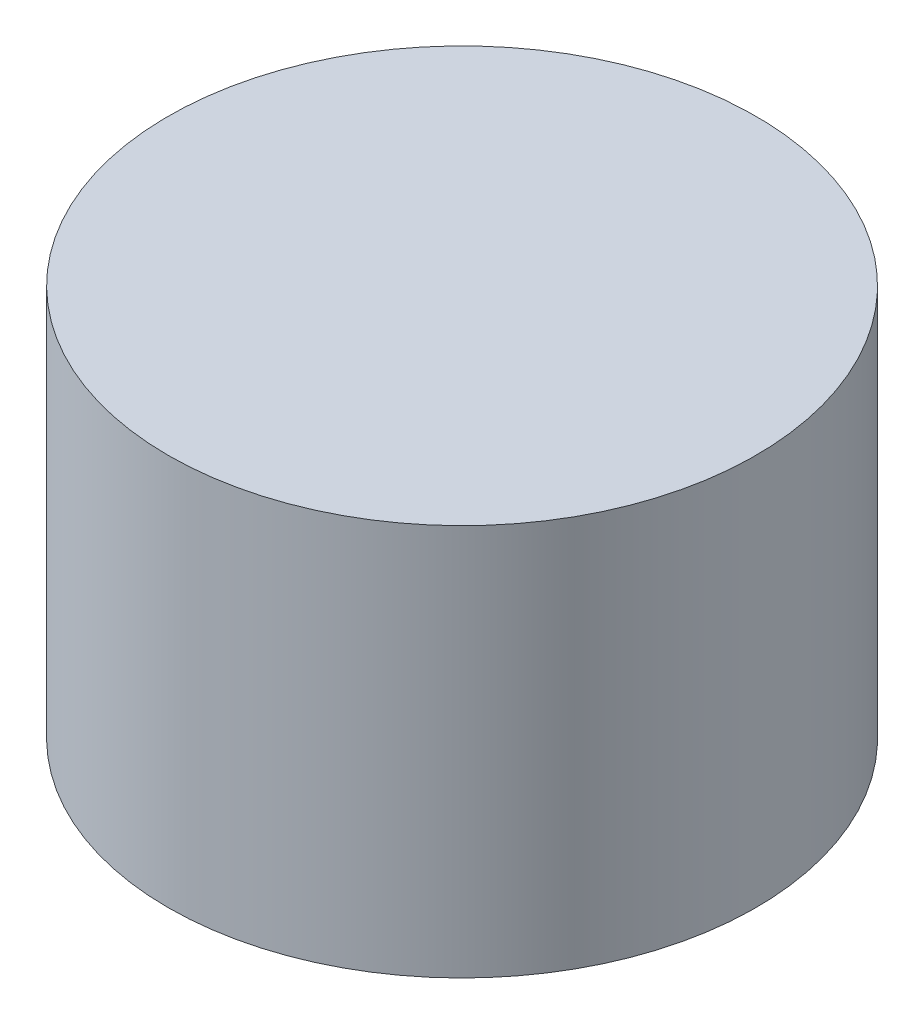
ISO-10303-21;
HEADER;
FILE_DESCRIPTION(('STEP AP214'),'2;1');
FILE_NAME('part.step','',(''),(''),'','','');
FILE_SCHEMA(('AUTOMOTIVE_DESIGN { 1 0 10303 214 1 1 1 1 }'));
ENDSEC;
DATA;
#1=APPLICATION_CONTEXT('core data for automotive mechanical design processes');
#2=APPLICATION_PROTOCOL_DEFINITION('international standard','automotive_design',2000,#1);
#3=PRODUCT_CONTEXT('',#1,'mechanical');
#4=PRODUCT('Part','Part','',(#3));
#5=PRODUCT_RELATED_PRODUCT_CATEGORY('part','',(#4));
#6=PRODUCT_DEFINITION_FORMATION('','',#4);
#7=PRODUCT_DEFINITION_CONTEXT('part definition',#1,'design');
#8=PRODUCT_DEFINITION('design','',#6,#7);
#9=PRODUCT_DEFINITION_SHAPE('','',#8);
#10=(LENGTH_UNIT() NAMED_UNIT(*) SI_UNIT(.MILLI.,.METRE.));
#11=(NAMED_UNIT(*) PLANE_ANGLE_UNIT() SI_UNIT($,.RADIAN.));
#12=(NAMED_UNIT(*) SI_UNIT($,.STERADIAN.) SOLID_ANGLE_UNIT());
#13=UNCERTAINTY_MEASURE_WITH_UNIT(LENGTH_MEASURE(1.E-05),#10,'distance_accuracy_value','');
#14=(GEOMETRIC_REPRESENTATION_CONTEXT(3) GLOBAL_UNCERTAINTY_ASSIGNED_CONTEXT((#13)) GLOBAL_UNIT_ASSIGNED_CONTEXT((#10,
#11,#12)) REPRESENTATION_CONTEXT('',''));
#15=CARTESIAN_POINT('',(0.,0.,0.));
#16=DIRECTION('',(0.,0.,1.));
#17=DIRECTION('',(1.,0.,0.));
#18=AXIS2_PLACEMENT_3D('',#15,#16,#17);
#19=CARTESIAN_POINT('',(0.,20.,0.));
#20=DIRECTION('',(0.,-1.,0.));
#21=DIRECTION('',(0.,0.,-1.));
#22=AXIS2_PLACEMENT_3D('',#19,#20,#21);
#23=CYLINDRICAL_SURFACE('',#22,15.);
#24=CARTESIAN_POINT('',(0.,20.,0.));
#25=DIRECTION('',(0.,1.,0.));
#26=DIRECTION('',(0.,0.,1.));
#27=AXIS2_PLACEMENT_3D('',#24,#25,#26);
#28=CIRCLE('',#27,15.);
#29=CARTESIAN_POINT('',(0.,20.,15.));
#30=VERTEX_POINT('',#29);
#31=EDGE_CURVE('E10',#30,#30,#28,.T.);
#32=ORIENTED_EDGE('',*,*,#31,.F.);
#33=EDGE_LOOP('',(#32));
#34=FACE_BOUND('',#33,.T.);
#35=CARTESIAN_POINT('',(0.,0.,0.));
#36=DIRECTION('',(0.,1.,0.));
#37=DIRECTION('',(0.,0.,1.));
#38=AXIS2_PLACEMENT_3D('',#35,#36,#37);
#39=CIRCLE('',#38,15.);
#40=CARTESIAN_POINT('',(0.,0.,15.));
#41=VERTEX_POINT('',#40);
#42=EDGE_CURVE('E35',#41,#41,#39,.T.);
#43=ORIENTED_EDGE('',*,*,#42,.T.);
#44=EDGE_LOOP('',(#43));
#45=FACE_BOUND('',#44,.T.);
#46=ADVANCED_FACE('F32',(#34,#45),#23,.T.);
#47=CARTESIAN_POINT('',(0.,20.,0.));
#48=DIRECTION('',(0.,1.,0.));
#49=DIRECTION('',(0.,0.,1.));
#50=AXIS2_PLACEMENT_3D('',#47,#48,#49);
#51=PLANE('',#50);
#52=ORIENTED_EDGE('',*,*,#31,.T.);
#53=EDGE_LOOP('',(#52));
#54=FACE_BOUND('',#53,.T.);
#55=ADVANCED_FACE('F47',(#54),#51,.T.);
#56=CARTESIAN_POINT('',(0.,0.,0.));
#57=DIRECTION('',(0.,1.,0.));
#58=DIRECTION('',(0.,0.,1.));
#59=AXIS2_PLACEMENT_3D('',#56,#57,#58);
#60=PLANE('',#59);
#61=ORIENTED_EDGE('',*,*,#42,.F.);
#62=EDGE_LOOP('',(#61));
#63=FACE_BOUND('',#62,.T.);
#64=ADVANCED_FACE('F45',(#63),#60,.F.);
#65=CLOSED_SHELL('',(#46,#55,#64));
#66=MANIFOLD_SOLID_BREP('B2',#65);
#67=ADVANCED_BREP_SHAPE_REPRESENTATION('',(#18,#66),#14);
#68=SHAPE_DEFINITION_REPRESENTATION(#9,#67);
ENDSEC;
END-ISO-10303-21;
